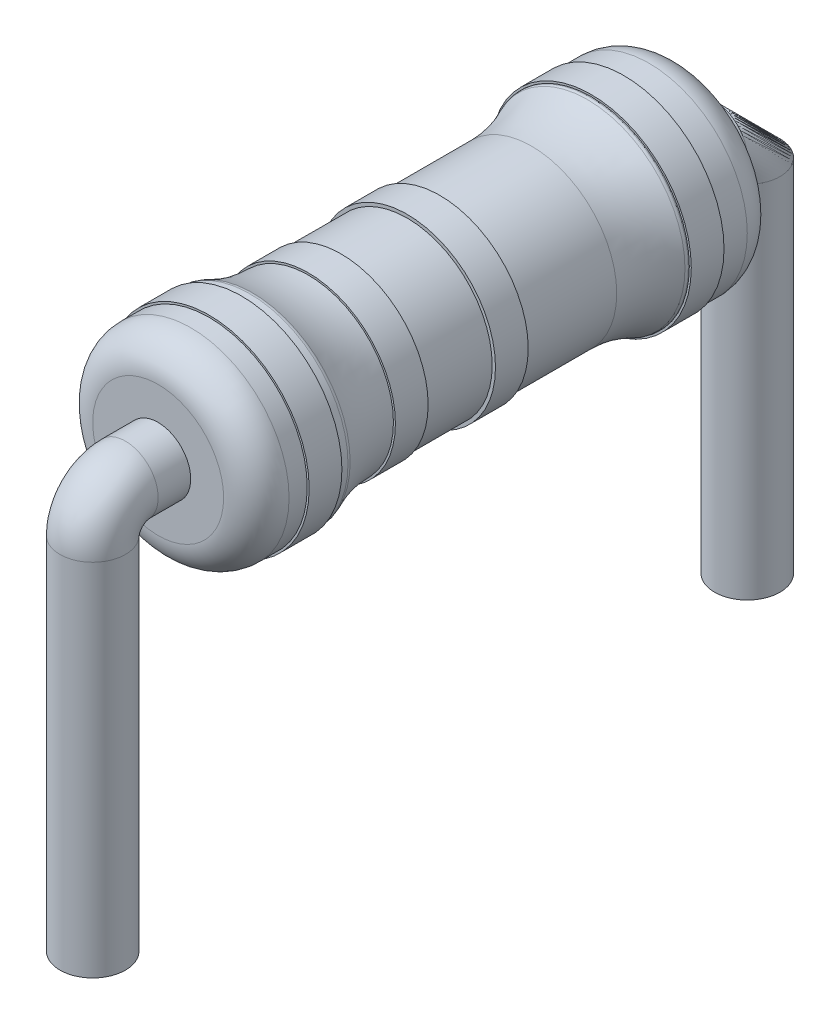
ISO-10303-21;
HEADER;
FILE_DESCRIPTION(('STEP AP214'),'2;1');
FILE_NAME('part.step','',(''),(''),'','','');
FILE_SCHEMA(('AUTOMOTIVE_DESIGN { 1 0 10303 214 1 1 1 1 }'));
ENDSEC;
DATA;
#1=APPLICATION_CONTEXT('core data for automotive mechanical design processes');
#2=APPLICATION_PROTOCOL_DEFINITION('international standard','automotive_design',2000,#1);
#3=PRODUCT_CONTEXT('',#1,'mechanical');
#4=PRODUCT('Part','Part','',(#3));
#5=PRODUCT_RELATED_PRODUCT_CATEGORY('part','',(#4));
#6=PRODUCT_DEFINITION_FORMATION('','',#4);
#7=PRODUCT_DEFINITION_CONTEXT('part definition',#1,'design');
#8=PRODUCT_DEFINITION('design','',#6,#7);
#9=PRODUCT_DEFINITION_SHAPE('','',#8);
#10=(LENGTH_UNIT() NAMED_UNIT(*) SI_UNIT(.MILLI.,.METRE.));
#11=(NAMED_UNIT(*) PLANE_ANGLE_UNIT() SI_UNIT($,.RADIAN.));
#12=(NAMED_UNIT(*) SI_UNIT($,.STERADIAN.) SOLID_ANGLE_UNIT());
#13=UNCERTAINTY_MEASURE_WITH_UNIT(LENGTH_MEASURE(1.E-05),#10,'distance_accuracy_value','');
#14=(GEOMETRIC_REPRESENTATION_CONTEXT(3) GLOBAL_UNCERTAINTY_ASSIGNED_CONTEXT((#13)) GLOBAL_UNIT_ASSIGNED_CONTEXT((#10,
#11,#12)) REPRESENTATION_CONTEXT('',''));
#15=CARTESIAN_POINT('',(0.,0.,0.));
#16=DIRECTION('',(0.,0.,1.));
#17=DIRECTION('',(1.,0.,0.));
#18=AXIS2_PLACEMENT_3D('',#15,#16,#17);
#19=CARTESIAN_POINT('',(0.,0.,-4.));
#20=DIRECTION('',(0.,0.,-1.));
#21=DIRECTION('',(-1.,0.,0.));
#22=AXIS2_PLACEMENT_3D('',#19,#20,#21);
#23=CYLINDRICAL_SURFACE('',#22,0.5);
#24=CARTESIAN_POINT('',(0.,0.,-4.));
#25=DIRECTION('',(0.,0.,-1.));
#26=DIRECTION('',(-1.,0.,0.));
#27=AXIS2_PLACEMENT_3D('',#24,#25,#26);
#28=CIRCLE('',#27,0.5);
#29=CARTESIAN_POINT('',(-0.5,0.,-4.));
#30=VERTEX_POINT('',#29);
#31=EDGE_CURVE('E52',#30,#30,#28,.T.);
#32=ORIENTED_EDGE('',*,*,#31,.T.);
#33=EDGE_LOOP('',(#32));
#34=FACE_BOUND('',#33,.T.);
#35=CARTESIAN_POINT('',(0.,0.,-4.5));
#36=DIRECTION('',(0.,0.,-1.));
#37=DIRECTION('',(-1.,0.,0.));
#38=AXIS2_PLACEMENT_3D('',#35,#36,#37);
#39=CIRCLE('',#38,0.5);
#40=CARTESIAN_POINT('',(0.,-0.5,-4.5));
#41=VERTEX_POINT('',#40);
#42=EDGE_CURVE('E12',#41,#41,#39,.T.);
#43=ORIENTED_EDGE('',*,*,#42,.F.);
#44=EDGE_LOOP('',(#43));
#45=FACE_BOUND('',#44,.T.);
#46=ADVANCED_FACE('F46',(#34,#45),#23,.T.);
#47=CARTESIAN_POINT('',(0.,-0.5,-4.5));
#48=DIRECTION('',(-1.,0.,0.));
#49=DIRECTION('',(0.,0.,1.));
#50=AXIS2_PLACEMENT_3D('',#47,#48,#49);
#51=DEGENERATE_TOROIDAL_SURFACE('',#50,0.5,0.5,.T.);
#52=CARTESIAN_POINT('',(0.,-0.5,-5.));
#53=DIRECTION('',(0.,-1.,0.));
#54=DIRECTION('',(-1.,0.,0.));
#55=AXIS2_PLACEMENT_3D('',#52,#53,#54);
#56=CIRCLE('',#55,0.5);
#57=EDGE_CURVE('E57',#41,#41,#56,.T.);
#58=ORIENTED_EDGE('',*,*,#57,.F.);
#59=ORIENTED_EDGE('',*,*,#42,.T.);
#60=EDGE_LOOP('',(#58,#59));
#61=FACE_BOUND('',#60,.T.);
#62=ADVANCED_FACE('F69',(#61),#51,.T.);
#63=CARTESIAN_POINT('',(0.,-0.5,-5.));
#64=DIRECTION('',(0.,-1.,0.));
#65=DIRECTION('',(0.,0.,-1.));
#66=AXIS2_PLACEMENT_3D('',#63,#64,#65);
#67=CYLINDRICAL_SURFACE('',#66,0.5);
#68=ORIENTED_EDGE('',*,*,#57,.T.);
#69=EDGE_LOOP('',(#68));
#70=FACE_BOUND('',#69,.T.);
#71=CARTESIAN_POINT('',(0.,-6.,-5.));
#72=DIRECTION('',(0.,-1.,0.));
#73=DIRECTION('',(-1.,0.,0.));
#74=AXIS2_PLACEMENT_3D('',#71,#72,#73);
#75=CIRCLE('',#74,0.5);
#76=CARTESIAN_POINT('',(-0.5,-6.,-5.));
#77=VERTEX_POINT('',#76);
#78=EDGE_CURVE('E49',#77,#77,#75,.T.);
#79=ORIENTED_EDGE('',*,*,#78,.F.);
#80=EDGE_LOOP('',(#79));
#81=FACE_BOUND('',#80,.T.);
#82=ADVANCED_FACE('F47',(#70,#81),#67,.T.);
#83=OPEN_SHELL('',(#46,#62,#82));
#84=SHELL_BASED_SURFACE_MODEL('B2',(#83));
#85=CARTESIAN_POINT('',(0.,0.,4.00287776352005));
#86=DIRECTION('',(0.,0.,1.));
#87=DIRECTION('',(1.,0.,0.));
#88=AXIS2_PLACEMENT_3D('',#85,#86,#87);
#89=CYLINDRICAL_SURFACE('',#88,0.5);
#90=CARTESIAN_POINT('',(0.,0.,4.00287776352005));
#91=DIRECTION('',(0.,0.,1.));
#92=DIRECTION('',(1.,0.,0.));
#93=AXIS2_PLACEMENT_3D('',#90,#91,#92);
#94=CIRCLE('',#93,0.5);
#95=CARTESIAN_POINT('',(0.5,0.,4.00287776352005));
#96=VERTEX_POINT('',#95);
#97=EDGE_CURVE('E114',#96,#96,#94,.T.);
#98=ORIENTED_EDGE('',*,*,#97,.T.);
#99=EDGE_LOOP('',(#98));
#100=FACE_BOUND('',#99,.T.);
#101=CARTESIAN_POINT('',(0.,0.,4.5));
#102=DIRECTION('',(0.,0.,1.));
#103=DIRECTION('',(1.,0.,0.));
#104=AXIS2_PLACEMENT_3D('',#101,#102,#103);
#105=CIRCLE('',#104,0.5);
#106=CARTESIAN_POINT('',(0.,-0.5,4.5));
#107=VERTEX_POINT('',#106);
#108=EDGE_CURVE('E44',#107,#107,#105,.T.);
#109=ORIENTED_EDGE('',*,*,#108,.F.);
#110=EDGE_LOOP('',(#109));
#111=FACE_BOUND('',#110,.T.);
#112=ADVANCED_FACE('F107',(#100,#111),#89,.T.);
#113=CARTESIAN_POINT('',(0.,-0.5,4.));
#114=DIRECTION('',(0.,-1.,0.));
#115=DIRECTION('',(0.,0.,-1.));
#116=AXIS2_PLACEMENT_3D('',#113,#114,#115);
#117=CIRCLE('',#116,0.5);
#118=TRIMMED_CURVE('',#117,(PARAMETER_VALUE(-3.14159263251637)),
(PARAMETER_VALUE(3.14159263251637)),.T.,.PARAMETER.);
#119=CARTESIAN_POINT('',(0.,-0.5,4.5));
#120=DIRECTION('',(1.,0.,0.));
#121=AXIS1_PLACEMENT('',#119,#120);
#122=SURFACE_OF_REVOLUTION('',#118,#121);
#123=CARTESIAN_POINT('',(0.,-0.500000000000004,5.));
#124=DIRECTION('',(0.,-1.,0.));
#125=DIRECTION('',(1.,0.,0.));
#126=AXIS2_PLACEMENT_3D('',#123,#124,#125);
#127=CIRCLE('',#126,0.5);
#128=EDGE_CURVE('E119',#107,#107,#127,.T.);
#129=ORIENTED_EDGE('',*,*,#128,.F.);
#130=ORIENTED_EDGE('',*,*,#108,.T.);
#131=EDGE_LOOP('',(#129,#130));
#132=FACE_BOUND('',#131,.T.);
#133=ADVANCED_FACE('F108',(#132),#122,.T.);
#134=CARTESIAN_POINT('',(0.,-0.500000000000004,5.));
#135=DIRECTION('',(0.,-1.,0.));
#136=DIRECTION('',(0.,0.,-1.));
#137=AXIS2_PLACEMENT_3D('',#134,#135,#136);
#138=CYLINDRICAL_SURFACE('',#137,0.5);
#139=ORIENTED_EDGE('',*,*,#128,.T.);
#140=EDGE_LOOP('',(#139));
#141=FACE_BOUND('',#140,.T.);
#142=CARTESIAN_POINT('',(0.,-6.,5.));
#143=DIRECTION('',(0.,-1.,0.));
#144=DIRECTION('',(1.,0.,0.));
#145=AXIS2_PLACEMENT_3D('',#142,#143,#144);
#146=CIRCLE('',#145,0.5);
#147=CARTESIAN_POINT('',(0.5,-6.,5.));
#148=VERTEX_POINT('',#147);
#149=EDGE_CURVE('E111',#148,#148,#146,.T.);
#150=ORIENTED_EDGE('',*,*,#149,.F.);
#151=EDGE_LOOP('',(#150));
#152=FACE_BOUND('',#151,.T.);
#153=ADVANCED_FACE('F109',(#141,#152),#138,.T.);
#154=OPEN_SHELL('',(#112,#133,#153));
#155=SHELL_BASED_SURFACE_MODEL('B6',(#154));
#156=CARTESIAN_POINT('',(0.,0.,30.9468802698145));
#157=DIRECTION('',(0.,0.,1.));
#158=DIRECTION('',(1.,0.,0.));
#159=AXIS2_PLACEMENT_3D('',#156,#157,#158);
#160=CYLINDRICAL_SURFACE('',#159,1.5);
#161=CARTESIAN_POINT('',(0.,0.,-2.6));
#162=DIRECTION('',(0.,0.,1.));
#163=DIRECTION('',(1.,0.,0.));
#164=AXIS2_PLACEMENT_3D('',#161,#162,#163);
#165=CIRCLE('',#164,1.5);
#166=CARTESIAN_POINT('',(1.5,0.,-2.6));
#167=VERTEX_POINT('',#166);
#168=EDGE_CURVE('E208',#167,#167,#165,.T.);
#169=ORIENTED_EDGE('',*,*,#168,.F.);
#170=EDGE_LOOP('',(#169));
#171=FACE_BOUND('',#170,.T.);
#172=CARTESIAN_POINT('',(0.,0.,-2.61454960934726));
#173=DIRECTION('',(0.,0.,-1.));
#174=DIRECTION('',(-1.,0.,0.));
#175=AXIS2_PLACEMENT_3D('',#172,#173,#174);
#176=CIRCLE('',#175,1.5);
#177=CARTESIAN_POINT('',(-1.5,0.,-2.61454960934726));
#178=VERTEX_POINT('',#177);
#179=EDGE_CURVE('E106',#178,#178,#176,.T.);
#180=ORIENTED_EDGE('',*,*,#179,.F.);
#181=EDGE_LOOP('',(#180));
#182=FACE_BOUND('',#181,.T.);
#183=ADVANCED_FACE('F161',(#171,#182),#160,.T.);
#184=CARTESIAN_POINT('',(0.,0.,30.9468802698145));
#185=DIRECTION('',(0.,0.,1.));
#186=DIRECTION('',(1.,0.,0.));
#187=AXIS2_PLACEMENT_3D('',#184,#185,#186);
#188=CYLINDRICAL_SURFACE('',#187,1.5);
#189=CARTESIAN_POINT('',(0.,0.,2.6));
#190=DIRECTION('',(0.,0.,1.));
#191=DIRECTION('',(1.,0.,0.));
#192=AXIS2_PLACEMENT_3D('',#189,#190,#191);
#193=CIRCLE('',#192,1.5);
#194=CARTESIAN_POINT('',(1.5,0.,2.6));
#195=VERTEX_POINT('',#194);
#196=EDGE_CURVE('E211',#195,#195,#193,.T.);
#197=ORIENTED_EDGE('',*,*,#196,.T.);
#198=EDGE_LOOP('',(#197));
#199=FACE_BOUND('',#198,.T.);
#200=CARTESIAN_POINT('',(0.,0.,2.7227576675328));
#201=DIRECTION('',(0.,0.,1.));
#202=DIRECTION('',(1.,0.,0.));
#203=AXIS2_PLACEMENT_3D('',#200,#201,#202);
#204=CIRCLE('',#203,1.5);
#205=CARTESIAN_POINT('',(1.5,0.,2.7227576675328));
#206=VERTEX_POINT('',#205);
#207=EDGE_CURVE('E176',#206,#206,#204,.T.);
#208=ORIENTED_EDGE('',*,*,#207,.F.);
#209=EDGE_LOOP('',(#208));
#210=FACE_BOUND('',#209,.T.);
#211=ADVANCED_FACE('F263',(#199,#210),#188,.T.);
#212=CARTESIAN_POINT('',(0.,0.,30.9468802698145));
#213=DIRECTION('',(0.,0.,1.));
#214=DIRECTION('',(1.,0.,0.));
#215=AXIS2_PLACEMENT_3D('',#212,#213,#214);
#216=CYLINDRICAL_SURFACE('',#215,1.3);
#217=CARTESIAN_POINT('',(0.,0.,1.20557280899656));
#218=DIRECTION('',(0.,0.,1.));
#219=DIRECTION('',(1.,0.,0.));
#220=AXIS2_PLACEMENT_3D('',#217,#218,#219);
#221=CIRCLE('',#220,1.3);
#222=CARTESIAN_POINT('',(1.3,0.,1.20557280899656));
#223=VERTEX_POINT('',#222);
#224=EDGE_CURVE('E187',#223,#223,#221,.T.);
#225=ORIENTED_EDGE('',*,*,#224,.F.);
#226=EDGE_LOOP('',(#225));
#227=FACE_BOUND('',#226,.T.);
#228=CARTESIAN_POINT('',(0.,0.,0.196800451709014));
#229=DIRECTION('',(0.,0.,-1.));
#230=DIRECTION('',(-1.,0.,0.));
#231=AXIS2_PLACEMENT_3D('',#228,#229,#230);
#232=CIRCLE('',#231,1.3);
#233=CARTESIAN_POINT('',(-1.3,0.,0.196800451709014));
#234=VERTEX_POINT('',#233);
#235=EDGE_CURVE('E181',#234,#234,#232,.T.);
#236=ORIENTED_EDGE('',*,*,#235,.F.);
#237=EDGE_LOOP('',(#236));
#238=FACE_BOUND('',#237,.T.);
#239=ADVANCED_FACE('F270',(#227,#238),#216,.T.);
#240=CARTESIAN_POINT('',(0.,1.3,1.70557280899656));
#241=DIRECTION('',(0.,0.,-1.));
#242=DIRECTION('',(-1.,0.,0.));
#243=AXIS2_PLACEMENT_3D('',#240,#241,#242);
#244=PLANE('',#243);
#245=CARTESIAN_POINT('',(0.,0.,1.70557280899656));
#246=DIRECTION('',(0.,0.,1.));
#247=DIRECTION('',(1.,0.,0.));
#248=AXIS2_PLACEMENT_3D('',#245,#246,#247);
#249=CIRCLE('',#248,1.3);
#250=CARTESIAN_POINT('',(1.3,0.,1.70557280899656));
#251=VERTEX_POINT('',#250);
#252=EDGE_CURVE('E193',#251,#251,#249,.F.);
#253=ORIENTED_EDGE('',*,*,#252,.T.);
#254=EDGE_LOOP('',(#253));
#255=FACE_BOUND('',#254,.T.);
#256=CARTESIAN_POINT('',(0.,0.,1.70557280899656));
#257=DIRECTION('',(0.,0.,1.));
#258=DIRECTION('',(1.,0.,0.));
#259=AXIS2_PLACEMENT_3D('',#256,#257,#258);
#260=CIRCLE('',#259,1.32999160819457);
#261=CARTESIAN_POINT('',(1.32999160819457,0.,1.70557280899656));
#262=VERTEX_POINT('',#261);
#263=EDGE_CURVE('E220',#262,#262,#260,.T.);
#264=ORIENTED_EDGE('',*,*,#263,.T.);
#265=EDGE_LOOP('',(#264));
#266=FACE_BOUND('',#265,.T.);
#267=ADVANCED_FACE('F348',(#255,#266),#244,.F.);
#268=CARTESIAN_POINT('',(0.,0.,2.18472406688181));
#269=DIRECTION('',(0.,0.,1.));
#270=DIRECTION('',(1.,0.,0.));
#271=AXIS2_PLACEMENT_3D('',#268,#269,#270);
#272=CYLINDRICAL_SURFACE('',#271,1.32999160819457);
#273=ORIENTED_EDGE('',*,*,#263,.F.);
#274=EDGE_LOOP('',(#273));
#275=FACE_BOUND('',#274,.T.);
#276=CARTESIAN_POINT('',(0.,0.,1.20557280899656));
#277=DIRECTION('',(0.,0.,1.));
#278=DIRECTION('',(1.,0.,0.));
#279=AXIS2_PLACEMENT_3D('',#276,#277,#278);
#280=CIRCLE('',#279,1.32999160819457);
#281=CARTESIAN_POINT('',(1.32999160819457,0.,1.20557280899656));
#282=VERTEX_POINT('',#281);
#283=EDGE_CURVE('E223',#282,#282,#280,.T.);
#284=ORIENTED_EDGE('',*,*,#283,.T.);
#285=EDGE_LOOP('',(#284));
#286=FACE_BOUND('',#285,.T.);
#287=ADVANCED_FACE('F344',(#275,#286),#272,.T.);
#288=CARTESIAN_POINT('',(0.,1.3,1.20557280899656));
#289=DIRECTION('',(0.,0.,1.));
#290=DIRECTION('',(1.,0.,0.));
#291=AXIS2_PLACEMENT_3D('',#288,#289,#290);
#292=PLANE('',#291);
#293=ORIENTED_EDGE('',*,*,#283,.F.);
#294=EDGE_LOOP('',(#293));
#295=FACE_BOUND('',#294,.T.);
#296=ORIENTED_EDGE('',*,*,#224,.T.);
#297=EDGE_LOOP('',(#296));
#298=FACE_BOUND('',#297,.T.);
#299=ADVANCED_FACE('F305',(#295,#298),#292,.F.);
#300=CARTESIAN_POINT('',(0.,0.,2.6));
#301=DIRECTION('',(0.,0.,1.));
#302=DIRECTION('',(1.,0.,0.));
#303=AXIS2_PLACEMENT_3D('',#300,#301,#302);
#304=TOROIDAL_SURFACE('',#303,1.4,0.0999999999999999);
#305=CARTESIAN_POINT('',(0.,0.,2.55740822899985));
#306=DIRECTION('',(0.,0.,1.));
#307=DIRECTION('',(1.,0.,0.));
#308=AXIS2_PLACEMENT_3D('',#305,#306,#307);
#309=CIRCLE('',#308,1.49047619047612);
#310=CARTESIAN_POINT('',(1.49047619047612,0.,2.55740822899985));
#311=VERTEX_POINT('',#310);
#312=EDGE_CURVE('E199',#311,#311,#309,.T.);
#313=ORIENTED_EDGE('',*,*,#312,.T.);
#314=EDGE_LOOP('',(#313));
#315=FACE_BOUND('',#314,.T.);
#316=ORIENTED_EDGE('',*,*,#196,.F.);
#317=EDGE_LOOP('',(#316));
#318=FACE_BOUND('',#317,.T.);
#319=ADVANCED_FACE('F296',(#315,#318),#304,.T.);
#320=CARTESIAN_POINT('',(0.,0.,1.70557280899656));
#321=DIRECTION('',(0.,0.,1.));
#322=DIRECTION('',(1.,0.,0.));
#323=AXIS2_PLACEMENT_3D('',#320,#321,#322);
#324=TOROIDAL_SURFACE('',#323,3.29999999999925,2.);
#325=ORIENTED_EDGE('',*,*,#252,.F.);
#326=EDGE_LOOP('',(#325));
#327=FACE_BOUND('',#326,.T.);
#328=ORIENTED_EDGE('',*,*,#312,.F.);
#329=EDGE_LOOP('',(#328));
#330=FACE_BOUND('',#329,.T.);
#331=ADVANCED_FACE('F293',(#327,#330),#324,.F.);
#332=CARTESIAN_POINT('',(0.,1.35,0.196800451709014));
#333=DIRECTION('',(0.,0.,-1.));
#334=DIRECTION('',(-1.,0.,0.));
#335=AXIS2_PLACEMENT_3D('',#332,#333,#334);
#336=PLANE('',#335);
#337=ORIENTED_EDGE('',*,*,#235,.T.);
#338=EDGE_LOOP('',(#337));
#339=FACE_BOUND('',#338,.T.);
#340=CARTESIAN_POINT('',(0.,0.,0.196800451709014));
#341=DIRECTION('',(0.,0.,1.));
#342=DIRECTION('',(1.,0.,0.));
#343=AXIS2_PLACEMENT_3D('',#340,#341,#342);
#344=CIRCLE('',#343,1.35);
#345=CARTESIAN_POINT('',(1.35,0.,0.196800451709014));
#346=VERTEX_POINT('',#345);
#347=EDGE_CURVE('E229',#346,#346,#344,.T.);
#348=ORIENTED_EDGE('',*,*,#347,.T.);
#349=EDGE_LOOP('',(#348));
#350=FACE_BOUND('',#349,.T.);
#351=ADVANCED_FACE('F295',(#339,#350),#336,.F.);
#352=CARTESIAN_POINT('',(0.,1.35,-0.303199548290986));
#353=DIRECTION('',(0.,0.,1.));
#354=DIRECTION('',(1.,0.,0.));
#355=AXIS2_PLACEMENT_3D('',#352,#353,#354);
#356=PLANE('',#355);
#357=CARTESIAN_POINT('',(0.,0.,-0.303199548290986));
#358=DIRECTION('',(0.,0.,1.));
#359=DIRECTION('',(1.,0.,0.));
#360=AXIS2_PLACEMENT_3D('',#357,#358,#359);
#361=CIRCLE('',#360,1.35);
#362=CARTESIAN_POINT('',(1.35,0.,-0.303199548290986));
#363=VERTEX_POINT('',#362);
#364=EDGE_CURVE('E226',#363,#363,#361,.T.);
#365=ORIENTED_EDGE('',*,*,#364,.F.);
#366=EDGE_LOOP('',(#365));
#367=FACE_BOUND('',#366,.T.);
#368=CARTESIAN_POINT('',(0.,0.,-0.303199548290986));
#369=DIRECTION('',(0.,0.,1.));
#370=DIRECTION('',(1.,0.,0.));
#371=AXIS2_PLACEMENT_3D('',#368,#369,#370);
#372=CIRCLE('',#371,1.3);
#373=CARTESIAN_POINT('',(1.3,0.,-0.303199548290986));
#374=VERTEX_POINT('',#373);
#375=EDGE_CURVE('E184',#374,#374,#372,.T.);
#376=ORIENTED_EDGE('',*,*,#375,.T.);
#377=EDGE_LOOP('',(#376));
#378=FACE_BOUND('',#377,.T.);
#379=ADVANCED_FACE('F302',(#367,#378),#356,.F.);
#380=CARTESIAN_POINT('',(0.,0.,0.489395269526655));
#381=DIRECTION('',(0.,0.,1.));
#382=DIRECTION('',(1.,0.,0.));
#383=AXIS2_PLACEMENT_3D('',#380,#381,#382);
#384=CYLINDRICAL_SURFACE('',#383,1.35);
#385=ORIENTED_EDGE('',*,*,#347,.F.);
#386=EDGE_LOOP('',(#385));
#387=FACE_BOUND('',#386,.T.);
#388=ORIENTED_EDGE('',*,*,#364,.T.);
#389=EDGE_LOOP('',(#388));
#390=FACE_BOUND('',#389,.T.);
#391=ADVANCED_FACE('F334',(#387,#390),#384,.T.);
#392=CARTESIAN_POINT('',(0.,0.,-2.6));
#393=DIRECTION('',(0.,0.,1.));
#394=DIRECTION('',(1.,0.,0.));
#395=AXIS2_PLACEMENT_3D('',#392,#393,#394);
#396=TOROIDAL_SURFACE('',#395,1.4,0.0999999999999998);
#397=CARTESIAN_POINT('',(0.,0.,-2.55740822899985));
#398=DIRECTION('',(0.,0.,-1.));
#399=DIRECTION('',(-1.,0.,0.));
#400=AXIS2_PLACEMENT_3D('',#397,#398,#399);
#401=CIRCLE('',#400,1.49047619047612);
#402=CARTESIAN_POINT('',(-1.49047619047612,0.,-2.55740822899985));
#403=VERTEX_POINT('',#402);
#404=EDGE_CURVE('E190',#403,#403,#401,.T.);
#405=ORIENTED_EDGE('',*,*,#404,.T.);
#406=EDGE_LOOP('',(#405));
#407=FACE_BOUND('',#406,.T.);
#408=ORIENTED_EDGE('',*,*,#168,.T.);
#409=EDGE_LOOP('',(#408));
#410=FACE_BOUND('',#409,.T.);
#411=ADVANCED_FACE('F337',(#407,#410),#396,.T.);
#412=CARTESIAN_POINT('',(0.,0.,-1.70557280899656));
#413=DIRECTION('',(0.,0.,1.));
#414=DIRECTION('',(1.,0.,0.));
#415=AXIS2_PLACEMENT_3D('',#412,#413,#414);
#416=TOROIDAL_SURFACE('',#415,3.29999999999925,2.);
#417=ORIENTED_EDGE('',*,*,#404,.F.);
#418=EDGE_LOOP('',(#417));
#419=FACE_BOUND('',#418,.T.);
#420=CARTESIAN_POINT('',(0.,0.,-1.70557280899657));
#421=DIRECTION('',(0.,0.,1.));
#422=DIRECTION('',(1.,0.,0.));
#423=AXIS2_PLACEMENT_3D('',#420,#421,#422);
#424=CIRCLE('',#423,1.3);
#425=CARTESIAN_POINT('',(1.3,0.,-1.70557280899657));
#426=VERTEX_POINT('',#425);
#427=EDGE_CURVE('E196',#426,#426,#424,.T.);
#428=ORIENTED_EDGE('',*,*,#427,.F.);
#429=EDGE_LOOP('',(#428));
#430=FACE_BOUND('',#429,.T.);
#431=ADVANCED_FACE('F163',(#419,#430),#416,.F.);
#432=ORIENTED_EDGE('',*,*,#427,.T.);
#433=EDGE_LOOP('',(#432));
#434=FACE_BOUND('',#433,.T.);
#435=ORIENTED_EDGE('',*,*,#375,.F.);
#436=EDGE_LOOP('',(#435));
#437=FACE_BOUND('',#436,.T.);
#438=ADVANCED_FACE('F329',(#434,#437),#216,.T.);
#439=CARTESIAN_POINT('',(0.,1.53,3.2227576675328));
#440=DIRECTION('',(0.,0.,-1.));
#441=DIRECTION('',(-1.,0.,0.));
#442=AXIS2_PLACEMENT_3D('',#439,#440,#441);
#443=PLANE('',#442);
#444=CARTESIAN_POINT('',(0.,0.,3.2227576675328));
#445=DIRECTION('',(0.,0.,-1.));
#446=DIRECTION('',(-1.,0.,0.));
#447=AXIS2_PLACEMENT_3D('',#444,#445,#446);
#448=CIRCLE('',#447,1.5);
#449=CARTESIAN_POINT('',(-1.5,0.,3.2227576675328));
#450=VERTEX_POINT('',#449);
#451=EDGE_CURVE('E172',#450,#450,#448,.T.);
#452=ORIENTED_EDGE('',*,*,#451,.T.);
#453=EDGE_LOOP('',(#452));
#454=FACE_BOUND('',#453,.T.);
#455=CARTESIAN_POINT('',(0.,0.,3.2227576675328));
#456=DIRECTION('',(0.,0.,1.));
#457=DIRECTION('',(1.,0.,0.));
#458=AXIS2_PLACEMENT_3D('',#455,#456,#457);
#459=CIRCLE('',#458,1.53);
#460=CARTESIAN_POINT('',(1.53,0.,3.2227576675328));
#461=VERTEX_POINT('',#460);
#462=EDGE_CURVE('E235',#461,#461,#459,.T.);
#463=ORIENTED_EDGE('',*,*,#462,.T.);
#464=EDGE_LOOP('',(#463));
#465=FACE_BOUND('',#464,.T.);
#466=ADVANCED_FACE('F319',(#454,#465),#443,.F.);
#467=CARTESIAN_POINT('',(0.,1.53,2.7227576675328));
#468=DIRECTION('',(0.,0.,1.));
#469=DIRECTION('',(1.,0.,0.));
#470=AXIS2_PLACEMENT_3D('',#467,#468,#469);
#471=PLANE('',#470);
#472=CARTESIAN_POINT('',(0.,0.,2.7227576675328));
#473=DIRECTION('',(0.,0.,1.));
#474=DIRECTION('',(1.,0.,0.));
#475=AXIS2_PLACEMENT_3D('',#472,#473,#474);
#476=CIRCLE('',#475,1.53);
#477=CARTESIAN_POINT('',(1.53,0.,2.7227576675328));
#478=VERTEX_POINT('',#477);
#479=EDGE_CURVE('E232',#478,#478,#476,.T.);
#480=ORIENTED_EDGE('',*,*,#479,.F.);
#481=EDGE_LOOP('',(#480));
#482=FACE_BOUND('',#481,.T.);
#483=ORIENTED_EDGE('',*,*,#207,.T.);
#484=EDGE_LOOP('',(#483));
#485=FACE_BOUND('',#484,.T.);
#486=ADVANCED_FACE('F316',(#482,#485),#471,.F.);
#487=CARTESIAN_POINT('',(0.,0.,0.449237837598222));
#488=DIRECTION('',(0.,0.,1.));
#489=DIRECTION('',(1.,0.,0.));
#490=AXIS2_PLACEMENT_3D('',#487,#488,#489);
#491=CYLINDRICAL_SURFACE('',#490,1.53);
#492=ORIENTED_EDGE('',*,*,#462,.F.);
#493=EDGE_LOOP('',(#492));
#494=FACE_BOUND('',#493,.T.);
#495=ORIENTED_EDGE('',*,*,#479,.T.);
#496=EDGE_LOOP('',(#495));
#497=FACE_BOUND('',#496,.T.);
#498=ADVANCED_FACE('F318',(#494,#497),#491,.T.);
#499=CARTESIAN_POINT('',(0.,1.,4.));
#500=DIRECTION('',(0.,0.,-1.));
#501=DIRECTION('',(-1.,0.,0.));
#502=AXIS2_PLACEMENT_3D('',#499,#500,#501);
#503=PLANE('',#502);
#504=CARTESIAN_POINT('',(0.,0.,4.));
#505=DIRECTION('',(0.,0.,1.));
#506=DIRECTION('',(1.,0.,0.));
#507=AXIS2_PLACEMENT_3D('',#504,#505,#506);
#508=CIRCLE('',#507,1.);
#509=CARTESIAN_POINT('',(1.,0.,4.));
#510=VERTEX_POINT('',#509);
#511=EDGE_CURVE('E217',#510,#510,#508,.T.);
#512=ORIENTED_EDGE('',*,*,#511,.T.);
#513=EDGE_LOOP('',(#512));
#514=FACE_BOUND('',#513,.T.);
#515=ADVANCED_FACE('F326',(#514),#503,.F.);
#516=CARTESIAN_POINT('',(0.,0.,3.5));
#517=DIRECTION('',(0.,0.,1.));
#518=DIRECTION('',(1.,0.,0.));
#519=AXIS2_PLACEMENT_3D('',#516,#517,#518);
#520=TOROIDAL_SURFACE('',#519,1.,0.5);
#521=ORIENTED_EDGE('',*,*,#511,.F.);
#522=EDGE_LOOP('',(#521));
#523=FACE_BOUND('',#522,.T.);
#524=CARTESIAN_POINT('',(0.,0.,3.5));
#525=DIRECTION('',(0.,0.,1.));
#526=DIRECTION('',(1.,0.,0.));
#527=AXIS2_PLACEMENT_3D('',#524,#525,#526);
#528=CIRCLE('',#527,1.5);
#529=CARTESIAN_POINT('',(1.5,0.,3.5));
#530=VERTEX_POINT('',#529);
#531=EDGE_CURVE('E214',#530,#530,#528,.T.);
#532=ORIENTED_EDGE('',*,*,#531,.T.);
#533=EDGE_LOOP('',(#532));
#534=FACE_BOUND('',#533,.T.);
#535=ADVANCED_FACE('F355',(#523,#534),#520,.T.);
#536=ORIENTED_EDGE('',*,*,#531,.F.);
#537=EDGE_LOOP('',(#536));
#538=FACE_BOUND('',#537,.T.);
#539=ORIENTED_EDGE('',*,*,#451,.F.);
#540=EDGE_LOOP('',(#539));
#541=FACE_BOUND('',#540,.T.);
#542=ADVANCED_FACE('F260',(#538,#541),#188,.T.);
#543=CARTESIAN_POINT('',(0.,1.53,-2.61454960934726));
#544=DIRECTION('',(0.,0.,-1.));
#545=DIRECTION('',(-1.,0.,0.));
#546=AXIS2_PLACEMENT_3D('',#543,#544,#545);
#547=PLANE('',#546);
#548=ORIENTED_EDGE('',*,*,#179,.T.);
#549=EDGE_LOOP('',(#548));
#550=FACE_BOUND('',#549,.T.);
#551=CARTESIAN_POINT('',(0.,0.,-2.61454960934726));
#552=DIRECTION('',(0.,0.,1.));
#553=DIRECTION('',(1.,0.,0.));
#554=AXIS2_PLACEMENT_3D('',#551,#552,#553);
#555=CIRCLE('',#554,1.53);
#556=CARTESIAN_POINT('',(1.53,0.,-2.61454960934726));
#557=VERTEX_POINT('',#556);
#558=EDGE_CURVE('E241',#557,#557,#555,.T.);
#559=ORIENTED_EDGE('',*,*,#558,.T.);
#560=EDGE_LOOP('',(#559));
#561=FACE_BOUND('',#560,.T.);
#562=ADVANCED_FACE('F245',(#550,#561),#547,.F.);
#563=CARTESIAN_POINT('',(0.,1.53,-3.11454960934726));
#564=DIRECTION('',(0.,0.,1.));
#565=DIRECTION('',(1.,0.,0.));
#566=AXIS2_PLACEMENT_3D('',#563,#564,#565);
#567=PLANE('',#566);
#568=CARTESIAN_POINT('',(0.,0.,-3.11454960934726));
#569=DIRECTION('',(0.,0.,1.));
#570=DIRECTION('',(1.,0.,0.));
#571=AXIS2_PLACEMENT_3D('',#568,#569,#570);
#572=CIRCLE('',#571,1.53);
#573=CARTESIAN_POINT('',(1.53,0.,-3.11454960934726));
#574=VERTEX_POINT('',#573);
#575=EDGE_CURVE('E238',#574,#574,#572,.T.);
#576=ORIENTED_EDGE('',*,*,#575,.F.);
#577=EDGE_LOOP('',(#576));
#578=FACE_BOUND('',#577,.T.);
#579=CARTESIAN_POINT('',(0.,0.,-3.11454960934726));
#580=DIRECTION('',(0.,0.,1.));
#581=DIRECTION('',(1.,0.,0.));
#582=AXIS2_PLACEMENT_3D('',#579,#580,#581);
#583=CIRCLE('',#582,1.5);
#584=CARTESIAN_POINT('',(1.5,0.,-3.11454960934726));
#585=VERTEX_POINT('',#584);
#586=EDGE_CURVE('E168',#585,#585,#583,.T.);
#587=ORIENTED_EDGE('',*,*,#586,.T.);
#588=EDGE_LOOP('',(#587));
#589=FACE_BOUND('',#588,.T.);
#590=ADVANCED_FACE('F251',(#578,#589),#567,.F.);
#591=CARTESIAN_POINT('',(0.,0.,0.313399994482615));
#592=DIRECTION('',(0.,0.,1.));
#593=DIRECTION('',(1.,0.,0.));
#594=AXIS2_PLACEMENT_3D('',#591,#592,#593);
#595=CYLINDRICAL_SURFACE('',#594,1.53);
#596=ORIENTED_EDGE('',*,*,#558,.F.);
#597=EDGE_LOOP('',(#596));
#598=FACE_BOUND('',#597,.T.);
#599=ORIENTED_EDGE('',*,*,#575,.T.);
#600=EDGE_LOOP('',(#599));
#601=FACE_BOUND('',#600,.T.);
#602=ADVANCED_FACE('F247',(#598,#601),#595,.T.);
#603=CARTESIAN_POINT('',(0.,1.,-4.));
#604=DIRECTION('',(0.,0.,1.));
#605=DIRECTION('',(1.,0.,0.));
#606=AXIS2_PLACEMENT_3D('',#603,#604,#605);
#607=PLANE('',#606);
#608=CARTESIAN_POINT('',(0.,0.,-4.));
#609=DIRECTION('',(0.,0.,1.));
#610=DIRECTION('',(1.,0.,0.));
#611=AXIS2_PLACEMENT_3D('',#608,#609,#610);
#612=CIRCLE('',#611,1.);
#613=CARTESIAN_POINT('',(1.,0.,-4.));
#614=VERTEX_POINT('',#613);
#615=EDGE_CURVE('E202',#614,#614,#612,.T.);
#616=ORIENTED_EDGE('',*,*,#615,.F.);
#617=EDGE_LOOP('',(#616));
#618=FACE_BOUND('',#617,.T.);
#619=ADVANCED_FACE('F250',(#618),#607,.F.);
#620=CARTESIAN_POINT('',(0.,0.,-3.5));
#621=DIRECTION('',(0.,0.,1.));
#622=DIRECTION('',(1.,0.,0.));
#623=AXIS2_PLACEMENT_3D('',#620,#621,#622);
#624=TOROIDAL_SURFACE('',#623,1.,0.5);
#625=CARTESIAN_POINT('',(0.,0.,-3.5));
#626=DIRECTION('',(0.,0.,1.));
#627=DIRECTION('',(1.,0.,0.));
#628=AXIS2_PLACEMENT_3D('',#625,#626,#627);
#629=CIRCLE('',#628,1.5);
#630=CARTESIAN_POINT('',(1.5,0.,-3.5));
#631=VERTEX_POINT('',#630);
#632=EDGE_CURVE('E205',#631,#631,#629,.T.);
#633=ORIENTED_EDGE('',*,*,#632,.F.);
#634=EDGE_LOOP('',(#633));
#635=FACE_BOUND('',#634,.T.);
#636=ORIENTED_EDGE('',*,*,#615,.T.);
#637=EDGE_LOOP('',(#636));
#638=FACE_BOUND('',#637,.T.);
#639=ADVANCED_FACE('F278',(#635,#638),#624,.T.);
#640=ORIENTED_EDGE('',*,*,#632,.T.);
#641=EDGE_LOOP('',(#640));
#642=FACE_BOUND('',#641,.T.);
#643=ORIENTED_EDGE('',*,*,#586,.F.);
#644=EDGE_LOOP('',(#643));
#645=FACE_BOUND('',#644,.T.);
#646=ADVANCED_FACE('F266',(#642,#645),#160,.T.);
#647=CLOSED_SHELL('',(#183,#211,#239,#267,#287,#299,#319,#331,#351,#379,#391,#411,#431,#438,
#466,#486,#498,#515,#535,#542,#562,#590,#602,#619,#639,#646));
#648=MANIFOLD_SOLID_BREP('B38',#647);
#649=ADVANCED_BREP_SHAPE_REPRESENTATION('',(#18,#648),#14);
#650=MANIFOLD_SURFACE_SHAPE_REPRESENTATION('',(#18,#84,#155),#14);
#651=SHAPE_REPRESENTATION('',(#18),#14);
#652=SHAPE_DEFINITION_REPRESENTATION(#9,#651);
#653=SHAPE_REPRESENTATION_RELATIONSHIP('','',#651,#649);
#654=SHAPE_REPRESENTATION_RELATIONSHIP('','',#651,#650);
ENDSEC;
END-ISO-10303-21;
